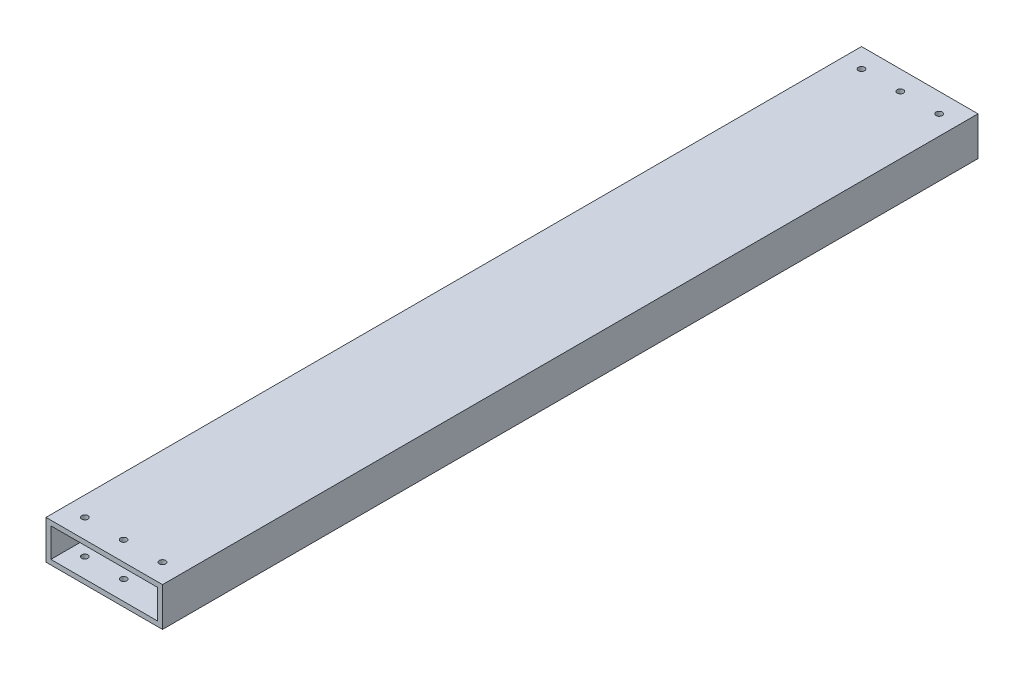
ISO-10303-21;
HEADER;
FILE_DESCRIPTION(('STEP AP214'),'2;1');
FILE_NAME('part.step','',(''),(''),'','','');
FILE_SCHEMA(('AUTOMOTIVE_DESIGN { 1 0 10303 214 1 1 1 1 }'));
ENDSEC;
DATA;
#1=APPLICATION_CONTEXT('core data for automotive mechanical design processes');
#2=APPLICATION_PROTOCOL_DEFINITION('international standard','automotive_design',2000,#1);
#3=PRODUCT_CONTEXT('',#1,'mechanical');
#4=PRODUCT('Part','Part','',(#3));
#5=PRODUCT_RELATED_PRODUCT_CATEGORY('part','',(#4));
#6=PRODUCT_DEFINITION_FORMATION('','',#4);
#7=PRODUCT_DEFINITION_CONTEXT('part definition',#1,'design');
#8=PRODUCT_DEFINITION('design','',#6,#7);
#9=PRODUCT_DEFINITION_SHAPE('','',#8);
#10=(LENGTH_UNIT() NAMED_UNIT(*) SI_UNIT(.MILLI.,.METRE.));
#11=(NAMED_UNIT(*) PLANE_ANGLE_UNIT() SI_UNIT($,.RADIAN.));
#12=(NAMED_UNIT(*) SI_UNIT($,.STERADIAN.) SOLID_ANGLE_UNIT());
#13=UNCERTAINTY_MEASURE_WITH_UNIT(LENGTH_MEASURE(1.E-05),#10,'distance_accuracy_value','');
#14=(GEOMETRIC_REPRESENTATION_CONTEXT(3) GLOBAL_UNCERTAINTY_ASSIGNED_CONTEXT((#13)) GLOBAL_UNIT_ASSIGNED_CONTEXT((#10,
#11,#12)) REPRESENTATION_CONTEXT('',''));
#15=CARTESIAN_POINT('',(0.,0.,0.));
#16=DIRECTION('',(0.,0.,1.));
#17=DIRECTION('',(1.,0.,0.));
#18=AXIS2_PLACEMENT_3D('',#15,#16,#17);
#19=CARTESIAN_POINT('',(0.,0.,266.7));
#20=DIRECTION('',(0.,0.,1.));
#21=DIRECTION('',(1.,0.,0.));
#22=AXIS2_PLACEMENT_3D('',#19,#20,#21);
#23=PLANE('',#22);
#24=DIRECTION('',(0.,1.,0.));
#25=VECTOR('',#24,1.);
#26=CARTESIAN_POINT('',(38.1,-12.7,266.7));
#27=LINE('',#26,#25);
#28=CARTESIAN_POINT('',(38.1,-12.7,266.7));
#29=VERTEX_POINT('',#28);
#30=CARTESIAN_POINT('',(38.1,12.7,266.7));
#31=VERTEX_POINT('',#30);
#32=EDGE_CURVE('E179',#29,#31,#27,.T.);
#33=ORIENTED_EDGE('',*,*,#32,.T.);
#34=DIRECTION('',(-1.,0.,0.));
#35=VECTOR('',#34,1.);
#36=CARTESIAN_POINT('',(-38.1,12.7,266.7));
#37=LINE('',#36,#35);
#38=CARTESIAN_POINT('',(-38.1,12.7,266.7));
#39=VERTEX_POINT('',#38);
#40=EDGE_CURVE('E183',#31,#39,#37,.T.);
#41=ORIENTED_EDGE('',*,*,#40,.T.);
#42=DIRECTION('',(0.,-1.,0.));
#43=VECTOR('',#42,1.);
#44=CARTESIAN_POINT('',(-38.1,-12.7,266.7));
#45=LINE('',#44,#43);
#46=CARTESIAN_POINT('',(-38.1,-12.7,266.7));
#47=VERTEX_POINT('',#46);
#48=EDGE_CURVE('E187',#39,#47,#45,.T.);
#49=ORIENTED_EDGE('',*,*,#48,.T.);
#50=DIRECTION('',(1.,0.,0.));
#51=VECTOR('',#50,1.);
#52=CARTESIAN_POINT('',(-38.1,-12.7,266.7));
#53=LINE('',#52,#51);
#54=EDGE_CURVE('E190',#47,#29,#53,.T.);
#55=ORIENTED_EDGE('',*,*,#54,.T.);
#56=EDGE_LOOP('',(#33,#41,#49,#55));
#57=FACE_BOUND('',#56,.T.);
#58=DIRECTION('',(-1.,0.,0.));
#59=VECTOR('',#58,1.);
#60=CARTESIAN_POINT('',(0.,9.525,266.7));
#61=LINE('',#60,#59);
#62=CARTESIAN_POINT('',(34.925,9.525,266.7));
#63=VERTEX_POINT('',#62);
#64=CARTESIAN_POINT('',(-34.925,9.525,266.7));
#65=VERTEX_POINT('',#64);
#66=EDGE_CURVE('E138',#63,#65,#61,.T.);
#67=ORIENTED_EDGE('',*,*,#66,.F.);
#68=DIRECTION('',(0.,1.,0.));
#69=VECTOR('',#68,1.);
#70=CARTESIAN_POINT('',(34.925,0.,266.7));
#71=LINE('',#70,#69);
#72=CARTESIAN_POINT('',(34.925,-9.525,266.7));
#73=VERTEX_POINT('',#72);
#74=EDGE_CURVE('E129',#73,#63,#71,.T.);
#75=ORIENTED_EDGE('',*,*,#74,.F.);
#76=DIRECTION('',(1.,0.,0.));
#77=VECTOR('',#76,1.);
#78=CARTESIAN_POINT('',(0.,-9.525,266.7));
#79=LINE('',#78,#77);
#80=CARTESIAN_POINT('',(-34.925,-9.525,266.7));
#81=VERTEX_POINT('',#80);
#82=EDGE_CURVE('E155',#81,#73,#79,.T.);
#83=ORIENTED_EDGE('',*,*,#82,.F.);
#84=DIRECTION('',(0.,-1.,0.));
#85=VECTOR('',#84,1.);
#86=CARTESIAN_POINT('',(-34.925,0.,266.7));
#87=LINE('',#86,#85);
#88=EDGE_CURVE('E151',#65,#81,#87,.T.);
#89=ORIENTED_EDGE('',*,*,#88,.F.);
#90=EDGE_LOOP('',(#67,#75,#83,#89));
#91=FACE_BOUND('',#90,.T.);
#92=ADVANCED_FACE('F61',(#57,#91),#23,.T.);
#93=CARTESIAN_POINT('',(0.,0.,-266.7));
#94=DIRECTION('',(0.,0.,1.));
#95=DIRECTION('',(1.,0.,0.));
#96=AXIS2_PLACEMENT_3D('',#93,#94,#95);
#97=PLANE('',#96);
#98=DIRECTION('',(0.,1.,0.));
#99=VECTOR('',#98,1.);
#100=CARTESIAN_POINT('',(38.1,-12.7,-266.7));
#101=LINE('',#100,#99);
#102=CARTESIAN_POINT('',(38.1,-12.7,-266.7));
#103=VERTEX_POINT('',#102);
#104=CARTESIAN_POINT('',(38.1,12.7,-266.7));
#105=VERTEX_POINT('',#104);
#106=EDGE_CURVE('E147',#103,#105,#101,.T.);
#107=ORIENTED_EDGE('',*,*,#106,.F.);
#108=DIRECTION('',(1.,0.,0.));
#109=VECTOR('',#108,1.);
#110=CARTESIAN_POINT('',(-38.1,-12.7,-266.7));
#111=LINE('',#110,#109);
#112=CARTESIAN_POINT('',(-38.1,-12.7,-266.7));
#113=VERTEX_POINT('',#112);
#114=EDGE_CURVE('E184',#113,#103,#111,.T.);
#115=ORIENTED_EDGE('',*,*,#114,.F.);
#116=DIRECTION('',(0.,-1.,0.));
#117=VECTOR('',#116,1.);
#118=CARTESIAN_POINT('',(-38.1,-12.7,-266.7));
#119=LINE('',#118,#117);
#120=CARTESIAN_POINT('',(-38.1,12.7,-266.7));
#121=VERTEX_POINT('',#120);
#122=EDGE_CURVE('E200',#121,#113,#119,.T.);
#123=ORIENTED_EDGE('',*,*,#122,.F.);
#124=DIRECTION('',(-1.,0.,0.));
#125=VECTOR('',#124,1.);
#126=CARTESIAN_POINT('',(-38.1,12.7,-266.7));
#127=LINE('',#126,#125);
#128=EDGE_CURVE('E197',#105,#121,#127,.T.);
#129=ORIENTED_EDGE('',*,*,#128,.F.);
#130=EDGE_LOOP('',(#107,#115,#123,#129));
#131=FACE_BOUND('',#130,.T.);
#132=DIRECTION('',(0.,1.,0.));
#133=VECTOR('',#132,1.);
#134=CARTESIAN_POINT('',(34.925,0.,-266.7));
#135=LINE('',#134,#133);
#136=CARTESIAN_POINT('',(34.925,-9.525,-266.7));
#137=VERTEX_POINT('',#136);
#138=CARTESIAN_POINT('',(34.925,9.525,-266.7));
#139=VERTEX_POINT('',#138);
#140=EDGE_CURVE('E87',#137,#139,#135,.T.);
#141=ORIENTED_EDGE('',*,*,#140,.T.);
#142=DIRECTION('',(-1.,0.,0.));
#143=VECTOR('',#142,1.);
#144=CARTESIAN_POINT('',(0.,9.525,-266.7));
#145=LINE('',#144,#143);
#146=CARTESIAN_POINT('',(-34.925,9.525,-266.7));
#147=VERTEX_POINT('',#146);
#148=EDGE_CURVE('E145',#139,#147,#145,.T.);
#149=ORIENTED_EDGE('',*,*,#148,.T.);
#150=DIRECTION('',(0.,-1.,0.));
#151=VECTOR('',#150,1.);
#152=CARTESIAN_POINT('',(-34.925,0.,-266.7));
#153=LINE('',#152,#151);
#154=CARTESIAN_POINT('',(-34.925,-9.525,-266.7));
#155=VERTEX_POINT('',#154);
#156=EDGE_CURVE('E166',#147,#155,#153,.T.);
#157=ORIENTED_EDGE('',*,*,#156,.T.);
#158=DIRECTION('',(1.,0.,0.));
#159=VECTOR('',#158,1.);
#160=CARTESIAN_POINT('',(0.,-9.525,-266.7));
#161=LINE('',#160,#159);
#162=EDGE_CURVE('E139',#155,#137,#161,.T.);
#163=ORIENTED_EDGE('',*,*,#162,.T.);
#164=EDGE_LOOP('',(#141,#149,#157,#163));
#165=FACE_BOUND('',#164,.T.);
#166=ADVANCED_FACE('F278',(#131,#165),#97,.F.);
#167=CARTESIAN_POINT('',(38.1,-12.7,266.7));
#168=DIRECTION('',(-1.,0.,0.));
#169=DIRECTION('',(0.,0.,1.));
#170=AXIS2_PLACEMENT_3D('',#167,#168,#169);
#171=PLANE('',#170);
#172=ORIENTED_EDGE('',*,*,#106,.T.);
#173=DIRECTION('',(0.,0.,-1.));
#174=VECTOR('',#173,1.);
#175=CARTESIAN_POINT('',(38.1,12.7,266.7));
#176=LINE('',#175,#174);
#177=EDGE_CURVE('E12',#31,#105,#176,.T.);
#178=ORIENTED_EDGE('',*,*,#177,.F.);
#179=ORIENTED_EDGE('',*,*,#32,.F.);
#180=DIRECTION('',(0.,0.,-1.));
#181=VECTOR('',#180,1.);
#182=CARTESIAN_POINT('',(38.1,-12.7,266.7));
#183=LINE('',#182,#181);
#184=EDGE_CURVE('E193',#29,#103,#183,.T.);
#185=ORIENTED_EDGE('',*,*,#184,.T.);
#186=EDGE_LOOP('',(#172,#178,#179,#185));
#187=FACE_BOUND('',#186,.T.);
#188=ADVANCED_FACE('F63',(#187),#171,.F.);
#189=CARTESIAN_POINT('',(-38.1,12.7,266.7));
#190=DIRECTION('',(0.,-1.,0.));
#191=DIRECTION('',(0.,0.,-1.));
#192=AXIS2_PLACEMENT_3D('',#189,#190,#191);
#193=PLANE('',#192);
#194=CARTESIAN_POINT('',(-25.4,12.7,-254.));
#195=DIRECTION('',(0.,1.,0.));
#196=DIRECTION('',(0.,0.,1.));
#197=AXIS2_PLACEMENT_3D('',#194,#195,#196);
#198=CIRCLE('',#197,2.03200000000001);
#199=CARTESIAN_POINT('',(-25.4,12.7,-251.968));
#200=VERTEX_POINT('',#199);
#201=EDGE_CURVE('E314',#200,#200,#198,.T.);
#202=ORIENTED_EDGE('',*,*,#201,.F.);
#203=EDGE_LOOP('',(#202));
#204=FACE_BOUND('',#203,.T.);
#205=CARTESIAN_POINT('',(0.,12.7,254.));
#206=DIRECTION('',(0.,1.,0.));
#207=DIRECTION('',(0.,0.,1.));
#208=AXIS2_PLACEMENT_3D('',#205,#206,#207);
#209=CIRCLE('',#208,2.03200000000002);
#210=CARTESIAN_POINT('',(0.,12.7,256.032));
#211=VERTEX_POINT('',#210);
#212=EDGE_CURVE('E318',#211,#211,#209,.T.);
#213=ORIENTED_EDGE('',*,*,#212,.F.);
#214=EDGE_LOOP('',(#213));
#215=FACE_BOUND('',#214,.T.);
#216=CARTESIAN_POINT('',(25.4,12.7,254.));
#217=DIRECTION('',(0.,1.,0.));
#218=DIRECTION('',(0.,0.,1.));
#219=AXIS2_PLACEMENT_3D('',#216,#217,#218);
#220=CIRCLE('',#219,2.03200000000001);
#221=CARTESIAN_POINT('',(25.4,12.7,256.032));
#222=VERTEX_POINT('',#221);
#223=EDGE_CURVE('E322',#222,#222,#220,.T.);
#224=ORIENTED_EDGE('',*,*,#223,.F.);
#225=EDGE_LOOP('',(#224));
#226=FACE_BOUND('',#225,.T.);
#227=CARTESIAN_POINT('',(0.,12.7,-254.));
#228=DIRECTION('',(0.,1.,0.));
#229=DIRECTION('',(0.,0.,1.));
#230=AXIS2_PLACEMENT_3D('',#227,#228,#229);
#231=CIRCLE('',#230,2.03200000000002);
#232=CARTESIAN_POINT('',(0.,12.7,-251.968));
#233=VERTEX_POINT('',#232);
#234=EDGE_CURVE('E326',#233,#233,#231,.T.);
#235=ORIENTED_EDGE('',*,*,#234,.F.);
#236=EDGE_LOOP('',(#235));
#237=FACE_BOUND('',#236,.T.);
#238=CARTESIAN_POINT('',(-25.4,12.7,254.));
#239=DIRECTION('',(0.,1.,0.));
#240=DIRECTION('',(0.,0.,1.));
#241=AXIS2_PLACEMENT_3D('',#238,#239,#240);
#242=CIRCLE('',#241,2.03200000000001);
#243=CARTESIAN_POINT('',(-25.4,12.7,256.032));
#244=VERTEX_POINT('',#243);
#245=EDGE_CURVE('E330',#244,#244,#242,.T.);
#246=ORIENTED_EDGE('',*,*,#245,.F.);
#247=EDGE_LOOP('',(#246));
#248=FACE_BOUND('',#247,.T.);
#249=CARTESIAN_POINT('',(25.4,12.7,-254.));
#250=DIRECTION('',(0.,1.,0.));
#251=DIRECTION('',(0.,0.,1.));
#252=AXIS2_PLACEMENT_3D('',#249,#250,#251);
#253=CIRCLE('',#252,2.03200000000001);
#254=CARTESIAN_POINT('',(25.4,12.7,-251.968));
#255=VERTEX_POINT('',#254);
#256=EDGE_CURVE('E334',#255,#255,#253,.T.);
#257=ORIENTED_EDGE('',*,*,#256,.F.);
#258=EDGE_LOOP('',(#257));
#259=FACE_BOUND('',#258,.T.);
#260=ORIENTED_EDGE('',*,*,#128,.T.);
#261=DIRECTION('',(0.,0.,-1.));
#262=VECTOR('',#261,1.);
#263=CARTESIAN_POINT('',(-38.1,12.7,266.7));
#264=LINE('',#263,#262);
#265=EDGE_CURVE('E71',#39,#121,#264,.T.);
#266=ORIENTED_EDGE('',*,*,#265,.F.);
#267=ORIENTED_EDGE('',*,*,#40,.F.);
#268=ORIENTED_EDGE('',*,*,#177,.T.);
#269=EDGE_LOOP('',(#260,#266,#267,#268));
#270=FACE_BOUND('',#269,.T.);
#271=ADVANCED_FACE('F303',(#204,#215,#226,#237,#248,#259,#270),#193,.F.);
#272=CARTESIAN_POINT('',(-38.1,-12.7,266.7));
#273=DIRECTION('',(1.,0.,0.));
#274=DIRECTION('',(0.,0.,-1.));
#275=AXIS2_PLACEMENT_3D('',#272,#273,#274);
#276=PLANE('',#275);
#277=ORIENTED_EDGE('',*,*,#122,.T.);
#278=DIRECTION('',(0.,0.,-1.));
#279=VECTOR('',#278,1.);
#280=CARTESIAN_POINT('',(-38.1,-12.7,266.7));
#281=LINE('',#280,#279);
#282=EDGE_CURVE('E208',#47,#113,#281,.T.);
#283=ORIENTED_EDGE('',*,*,#282,.F.);
#284=ORIENTED_EDGE('',*,*,#48,.F.);
#285=ORIENTED_EDGE('',*,*,#265,.T.);
#286=EDGE_LOOP('',(#277,#283,#284,#285));
#287=FACE_BOUND('',#286,.T.);
#288=ADVANCED_FACE('F300',(#287),#276,.F.);
#289=CARTESIAN_POINT('',(-38.1,-12.7,266.7));
#290=DIRECTION('',(0.,1.,0.));
#291=DIRECTION('',(0.,0.,1.));
#292=AXIS2_PLACEMENT_3D('',#289,#290,#291);
#293=PLANE('',#292);
#294=CARTESIAN_POINT('',(-25.4,-12.7,-254.));
#295=DIRECTION('',(0.,1.,0.));
#296=DIRECTION('',(0.,0.,1.));
#297=AXIS2_PLACEMENT_3D('',#294,#295,#296);
#298=CIRCLE('',#297,2.03200000000001);
#299=CARTESIAN_POINT('',(-25.4,-12.7,-251.968));
#300=VERTEX_POINT('',#299);
#301=EDGE_CURVE('E432',#300,#300,#298,.T.);
#302=ORIENTED_EDGE('',*,*,#301,.T.);
#303=EDGE_LOOP('',(#302));
#304=FACE_BOUND('',#303,.T.);
#305=CARTESIAN_POINT('',(0.,-12.7,254.));
#306=DIRECTION('',(0.,1.,0.));
#307=DIRECTION('',(0.,0.,1.));
#308=AXIS2_PLACEMENT_3D('',#305,#306,#307);
#309=CIRCLE('',#308,2.03200000000002);
#310=CARTESIAN_POINT('',(0.,-12.7,256.032));
#311=VERTEX_POINT('',#310);
#312=EDGE_CURVE('E420',#311,#311,#309,.T.);
#313=ORIENTED_EDGE('',*,*,#312,.T.);
#314=EDGE_LOOP('',(#313));
#315=FACE_BOUND('',#314,.T.);
#316=CARTESIAN_POINT('',(25.4,-12.7,254.));
#317=DIRECTION('',(0.,1.,0.));
#318=DIRECTION('',(0.,0.,1.));
#319=AXIS2_PLACEMENT_3D('',#316,#317,#318);
#320=CIRCLE('',#319,2.03200000000001);
#321=CARTESIAN_POINT('',(25.4,-12.7,256.032));
#322=VERTEX_POINT('',#321);
#323=EDGE_CURVE('E419',#322,#322,#320,.T.);
#324=ORIENTED_EDGE('',*,*,#323,.T.);
#325=EDGE_LOOP('',(#324));
#326=FACE_BOUND('',#325,.T.);
#327=CARTESIAN_POINT('',(0.,-12.7,-254.));
#328=DIRECTION('',(0.,1.,0.));
#329=DIRECTION('',(0.,0.,1.));
#330=AXIS2_PLACEMENT_3D('',#327,#328,#329);
#331=CIRCLE('',#330,2.03200000000002);
#332=CARTESIAN_POINT('',(0.,-12.7,-251.968));
#333=VERTEX_POINT('',#332);
#334=EDGE_CURVE('E348',#333,#333,#331,.T.);
#335=ORIENTED_EDGE('',*,*,#334,.T.);
#336=EDGE_LOOP('',(#335));
#337=FACE_BOUND('',#336,.T.);
#338=CARTESIAN_POINT('',(-25.4,-12.7,254.));
#339=DIRECTION('',(0.,1.,0.));
#340=DIRECTION('',(0.,0.,1.));
#341=AXIS2_PLACEMENT_3D('',#338,#339,#340);
#342=CIRCLE('',#341,2.03200000000001);
#343=CARTESIAN_POINT('',(-25.4,-12.7,256.032));
#344=VERTEX_POINT('',#343);
#345=EDGE_CURVE('E433',#344,#344,#342,.T.);
#346=ORIENTED_EDGE('',*,*,#345,.T.);
#347=EDGE_LOOP('',(#346));
#348=FACE_BOUND('',#347,.T.);
#349=CARTESIAN_POINT('',(25.4,-12.7,-254.));
#350=DIRECTION('',(0.,1.,0.));
#351=DIRECTION('',(0.,0.,1.));
#352=AXIS2_PLACEMENT_3D('',#349,#350,#351);
#353=CIRCLE('',#352,2.03200000000001);
#354=CARTESIAN_POINT('',(25.4,-12.7,-251.968));
#355=VERTEX_POINT('',#354);
#356=EDGE_CURVE('E220',#355,#355,#353,.T.);
#357=ORIENTED_EDGE('',*,*,#356,.T.);
#358=EDGE_LOOP('',(#357));
#359=FACE_BOUND('',#358,.T.);
#360=ORIENTED_EDGE('',*,*,#114,.T.);
#361=ORIENTED_EDGE('',*,*,#184,.F.);
#362=ORIENTED_EDGE('',*,*,#54,.F.);
#363=ORIENTED_EDGE('',*,*,#282,.T.);
#364=EDGE_LOOP('',(#360,#361,#362,#363));
#365=FACE_BOUND('',#364,.T.);
#366=ADVANCED_FACE('F297',(#304,#315,#326,#337,#348,#359,#365),#293,.F.);
#367=CARTESIAN_POINT('',(34.925,0.,266.7));
#368=DIRECTION('',(-1.,0.,0.));
#369=DIRECTION('',(0.,0.,1.));
#370=AXIS2_PLACEMENT_3D('',#367,#368,#369);
#371=PLANE('',#370);
#372=ORIENTED_EDGE('',*,*,#140,.F.);
#373=DIRECTION('',(0.,0.,-1.));
#374=VECTOR('',#373,1.);
#375=CARTESIAN_POINT('',(34.925,-9.525,266.7));
#376=LINE('',#375,#374);
#377=EDGE_CURVE('E133',#73,#137,#376,.T.);
#378=ORIENTED_EDGE('',*,*,#377,.F.);
#379=ORIENTED_EDGE('',*,*,#74,.T.);
#380=DIRECTION('',(0.,0.,-1.));
#381=VECTOR('',#380,1.);
#382=CARTESIAN_POINT('',(34.925,9.525,266.7));
#383=LINE('',#382,#381);
#384=EDGE_CURVE('E132',#63,#139,#383,.T.);
#385=ORIENTED_EDGE('',*,*,#384,.T.);
#386=EDGE_LOOP('',(#372,#378,#379,#385));
#387=FACE_BOUND('',#386,.T.);
#388=ADVANCED_FACE('F131',(#387),#371,.T.);
#389=CARTESIAN_POINT('',(0.,9.525,266.7));
#390=DIRECTION('',(0.,-1.,0.));
#391=DIRECTION('',(0.,0.,-1.));
#392=AXIS2_PLACEMENT_3D('',#389,#390,#391);
#393=PLANE('',#392);
#394=CARTESIAN_POINT('',(-25.4,9.525,-254.));
#395=DIRECTION('',(0.,-1.,0.));
#396=DIRECTION('',(0.,0.,-1.));
#397=AXIS2_PLACEMENT_3D('',#394,#395,#396);
#398=CIRCLE('',#397,2.03200000000001);
#399=CARTESIAN_POINT('',(-25.4,9.525,-256.032));
#400=VERTEX_POINT('',#399);
#401=EDGE_CURVE('E163',#400,#400,#398,.T.);
#402=ORIENTED_EDGE('',*,*,#401,.F.);
#403=EDGE_LOOP('',(#402));
#404=FACE_BOUND('',#403,.T.);
#405=CARTESIAN_POINT('',(0.,9.525,254.));
#406=DIRECTION('',(0.,-1.,0.));
#407=DIRECTION('',(0.,0.,-1.));
#408=AXIS2_PLACEMENT_3D('',#405,#406,#407);
#409=CIRCLE('',#408,2.03200000000002);
#410=CARTESIAN_POINT('',(0.,9.525,251.968));
#411=VERTEX_POINT('',#410);
#412=EDGE_CURVE('E238',#411,#411,#409,.T.);
#413=ORIENTED_EDGE('',*,*,#412,.F.);
#414=EDGE_LOOP('',(#413));
#415=FACE_BOUND('',#414,.T.);
#416=CARTESIAN_POINT('',(25.4,9.525,254.));
#417=DIRECTION('',(0.,-1.,0.));
#418=DIRECTION('',(0.,0.,-1.));
#419=AXIS2_PLACEMENT_3D('',#416,#417,#418);
#420=CIRCLE('',#419,2.03200000000001);
#421=CARTESIAN_POINT('',(25.4,9.525,251.968));
#422=VERTEX_POINT('',#421);
#423=EDGE_CURVE('E234',#422,#422,#420,.T.);
#424=ORIENTED_EDGE('',*,*,#423,.F.);
#425=EDGE_LOOP('',(#424));
#426=FACE_BOUND('',#425,.T.);
#427=CARTESIAN_POINT('',(0.,9.525,-254.));
#428=DIRECTION('',(0.,-1.,0.));
#429=DIRECTION('',(0.,0.,-1.));
#430=AXIS2_PLACEMENT_3D('',#427,#428,#429);
#431=CIRCLE('',#430,2.03200000000002);
#432=CARTESIAN_POINT('',(0.,9.525,-256.032));
#433=VERTEX_POINT('',#432);
#434=EDGE_CURVE('E230',#433,#433,#431,.T.);
#435=ORIENTED_EDGE('',*,*,#434,.F.);
#436=EDGE_LOOP('',(#435));
#437=FACE_BOUND('',#436,.T.);
#438=CARTESIAN_POINT('',(-25.4,9.525,254.));
#439=DIRECTION('',(0.,-1.,0.));
#440=DIRECTION('',(0.,0.,-1.));
#441=AXIS2_PLACEMENT_3D('',#438,#439,#440);
#442=CIRCLE('',#441,2.03200000000001);
#443=CARTESIAN_POINT('',(-25.4,9.525,251.968));
#444=VERTEX_POINT('',#443);
#445=EDGE_CURVE('E225',#444,#444,#442,.T.);
#446=ORIENTED_EDGE('',*,*,#445,.F.);
#447=EDGE_LOOP('',(#446));
#448=FACE_BOUND('',#447,.T.);
#449=CARTESIAN_POINT('',(25.4,9.525,-254.));
#450=DIRECTION('',(0.,-1.,0.));
#451=DIRECTION('',(0.,0.,-1.));
#452=AXIS2_PLACEMENT_3D('',#449,#450,#451);
#453=CIRCLE('',#452,2.03200000000001);
#454=CARTESIAN_POINT('',(25.4,9.525,-256.032));
#455=VERTEX_POINT('',#454);
#456=EDGE_CURVE('E219',#455,#455,#453,.T.);
#457=ORIENTED_EDGE('',*,*,#456,.F.);
#458=EDGE_LOOP('',(#457));
#459=FACE_BOUND('',#458,.T.);
#460=ORIENTED_EDGE('',*,*,#148,.F.);
#461=ORIENTED_EDGE('',*,*,#384,.F.);
#462=ORIENTED_EDGE('',*,*,#66,.T.);
#463=DIRECTION('',(0.,0.,-1.));
#464=VECTOR('',#463,1.);
#465=CARTESIAN_POINT('',(-34.925,9.525,266.7));
#466=LINE('',#465,#464);
#467=EDGE_CURVE('E148',#65,#147,#466,.T.);
#468=ORIENTED_EDGE('',*,*,#467,.T.);
#469=EDGE_LOOP('',(#460,#461,#462,#468));
#470=FACE_BOUND('',#469,.T.);
#471=ADVANCED_FACE('F142',(#404,#415,#426,#437,#448,#459,#470),#393,.T.);
#472=CARTESIAN_POINT('',(-34.925,0.,266.7));
#473=DIRECTION('',(1.,0.,0.));
#474=DIRECTION('',(0.,0.,-1.));
#475=AXIS2_PLACEMENT_3D('',#472,#473,#474);
#476=PLANE('',#475);
#477=ORIENTED_EDGE('',*,*,#156,.F.);
#478=ORIENTED_EDGE('',*,*,#467,.F.);
#479=ORIENTED_EDGE('',*,*,#88,.T.);
#480=DIRECTION('',(0.,0.,-1.));
#481=VECTOR('',#480,1.);
#482=CARTESIAN_POINT('',(-34.925,-9.525,266.7));
#483=LINE('',#482,#481);
#484=EDGE_CURVE('E79',#81,#155,#483,.T.);
#485=ORIENTED_EDGE('',*,*,#484,.T.);
#486=EDGE_LOOP('',(#477,#478,#479,#485));
#487=FACE_BOUND('',#486,.T.);
#488=ADVANCED_FACE('F266',(#487),#476,.T.);
#489=CARTESIAN_POINT('',(0.,-9.525,266.7));
#490=DIRECTION('',(0.,1.,0.));
#491=DIRECTION('',(0.,0.,1.));
#492=AXIS2_PLACEMENT_3D('',#489,#490,#491);
#493=PLANE('',#492);
#494=CARTESIAN_POINT('',(-25.4,-9.525,-254.));
#495=DIRECTION('',(0.,1.,0.));
#496=DIRECTION('',(0.,0.,1.));
#497=AXIS2_PLACEMENT_3D('',#494,#495,#496);
#498=CIRCLE('',#497,2.03200000000001);
#499=CARTESIAN_POINT('',(-25.4,-9.525,-251.968));
#500=VERTEX_POINT('',#499);
#501=EDGE_CURVE('E65',#500,#500,#498,.T.);
#502=ORIENTED_EDGE('',*,*,#501,.F.);
#503=EDGE_LOOP('',(#502));
#504=FACE_BOUND('',#503,.T.);
#505=CARTESIAN_POINT('',(0.,-9.525,254.));
#506=DIRECTION('',(0.,1.,0.));
#507=DIRECTION('',(0.,0.,1.));
#508=AXIS2_PLACEMENT_3D('',#505,#506,#507);
#509=CIRCLE('',#508,2.03200000000002);
#510=CARTESIAN_POINT('',(0.,-9.525,256.032));
#511=VERTEX_POINT('',#510);
#512=EDGE_CURVE('E235',#511,#511,#509,.T.);
#513=ORIENTED_EDGE('',*,*,#512,.F.);
#514=EDGE_LOOP('',(#513));
#515=FACE_BOUND('',#514,.T.);
#516=CARTESIAN_POINT('',(25.4,-9.525,254.));
#517=DIRECTION('',(0.,1.,0.));
#518=DIRECTION('',(0.,0.,1.));
#519=AXIS2_PLACEMENT_3D('',#516,#517,#518);
#520=CIRCLE('',#519,2.03200000000001);
#521=CARTESIAN_POINT('',(25.4,-9.525,256.032));
#522=VERTEX_POINT('',#521);
#523=EDGE_CURVE('E231',#522,#522,#520,.T.);
#524=ORIENTED_EDGE('',*,*,#523,.F.);
#525=EDGE_LOOP('',(#524));
#526=FACE_BOUND('',#525,.T.);
#527=CARTESIAN_POINT('',(0.,-9.525,-254.));
#528=DIRECTION('',(0.,1.,0.));
#529=DIRECTION('',(0.,0.,1.));
#530=AXIS2_PLACEMENT_3D('',#527,#528,#529);
#531=CIRCLE('',#530,2.03200000000002);
#532=CARTESIAN_POINT('',(0.,-9.525,-251.968));
#533=VERTEX_POINT('',#532);
#534=EDGE_CURVE('E226',#533,#533,#531,.T.);
#535=ORIENTED_EDGE('',*,*,#534,.F.);
#536=EDGE_LOOP('',(#535));
#537=FACE_BOUND('',#536,.T.);
#538=CARTESIAN_POINT('',(-25.4,-9.525,254.));
#539=DIRECTION('',(0.,1.,0.));
#540=DIRECTION('',(0.,0.,1.));
#541=AXIS2_PLACEMENT_3D('',#538,#539,#540);
#542=CIRCLE('',#541,2.03200000000001);
#543=CARTESIAN_POINT('',(-25.4,-9.525,256.032));
#544=VERTEX_POINT('',#543);
#545=EDGE_CURVE('E221',#544,#544,#542,.T.);
#546=ORIENTED_EDGE('',*,*,#545,.F.);
#547=EDGE_LOOP('',(#546));
#548=FACE_BOUND('',#547,.T.);
#549=CARTESIAN_POINT('',(25.4,-9.525,-254.));
#550=DIRECTION('',(0.,1.,0.));
#551=DIRECTION('',(0.,0.,1.));
#552=AXIS2_PLACEMENT_3D('',#549,#550,#551);
#553=CIRCLE('',#552,2.03200000000001);
#554=CARTESIAN_POINT('',(25.4,-9.525,-251.968));
#555=VERTEX_POINT('',#554);
#556=EDGE_CURVE('E215',#555,#555,#553,.T.);
#557=ORIENTED_EDGE('',*,*,#556,.F.);
#558=EDGE_LOOP('',(#557));
#559=FACE_BOUND('',#558,.T.);
#560=ORIENTED_EDGE('',*,*,#162,.F.);
#561=ORIENTED_EDGE('',*,*,#484,.F.);
#562=ORIENTED_EDGE('',*,*,#82,.T.);
#563=ORIENTED_EDGE('',*,*,#377,.T.);
#564=EDGE_LOOP('',(#560,#561,#562,#563));
#565=FACE_BOUND('',#564,.T.);
#566=ADVANCED_FACE('F262',(#504,#515,#526,#537,#548,#559,#565),#493,.T.);
#567=CARTESIAN_POINT('',(25.4,-12.7,-254.));
#568=DIRECTION('',(0.,1.,0.));
#569=DIRECTION('',(0.,0.,1.));
#570=AXIS2_PLACEMENT_3D('',#567,#568,#569);
#571=CYLINDRICAL_SURFACE('',#570,2.03200000000001);
#572=ORIENTED_EDGE('',*,*,#556,.T.);
#573=EDGE_LOOP('',(#572));
#574=FACE_BOUND('',#573,.T.);
#575=ORIENTED_EDGE('',*,*,#356,.F.);
#576=EDGE_LOOP('',(#575));
#577=FACE_BOUND('',#576,.T.);
#578=ADVANCED_FACE('F265',(#574,#577),#571,.F.);
#579=CARTESIAN_POINT('',(-25.4,-12.7,254.));
#580=DIRECTION('',(0.,1.,0.));
#581=DIRECTION('',(0.,0.,1.));
#582=AXIS2_PLACEMENT_3D('',#579,#580,#581);
#583=CYLINDRICAL_SURFACE('',#582,2.03200000000001);
#584=ORIENTED_EDGE('',*,*,#545,.T.);
#585=EDGE_LOOP('',(#584));
#586=FACE_BOUND('',#585,.T.);
#587=ORIENTED_EDGE('',*,*,#345,.F.);
#588=EDGE_LOOP('',(#587));
#589=FACE_BOUND('',#588,.T.);
#590=ADVANCED_FACE('F379',(#586,#589),#583,.F.);
#591=CARTESIAN_POINT('',(0.,-12.7,-254.));
#592=DIRECTION('',(0.,1.,0.));
#593=DIRECTION('',(0.,0.,1.));
#594=AXIS2_PLACEMENT_3D('',#591,#592,#593);
#595=CYLINDRICAL_SURFACE('',#594,2.03200000000002);
#596=ORIENTED_EDGE('',*,*,#534,.T.);
#597=EDGE_LOOP('',(#596));
#598=FACE_BOUND('',#597,.T.);
#599=ORIENTED_EDGE('',*,*,#334,.F.);
#600=EDGE_LOOP('',(#599));
#601=FACE_BOUND('',#600,.T.);
#602=ADVANCED_FACE('F389',(#598,#601),#595,.F.);
#603=CARTESIAN_POINT('',(25.4,-12.7,254.));
#604=DIRECTION('',(0.,1.,0.));
#605=DIRECTION('',(0.,0.,1.));
#606=AXIS2_PLACEMENT_3D('',#603,#604,#605);
#607=CYLINDRICAL_SURFACE('',#606,2.03200000000001);
#608=ORIENTED_EDGE('',*,*,#523,.T.);
#609=EDGE_LOOP('',(#608));
#610=FACE_BOUND('',#609,.T.);
#611=ORIENTED_EDGE('',*,*,#323,.F.);
#612=EDGE_LOOP('',(#611));
#613=FACE_BOUND('',#612,.T.);
#614=ADVANCED_FACE('F397',(#610,#613),#607,.F.);
#615=CARTESIAN_POINT('',(0.,-12.7,254.));
#616=DIRECTION('',(0.,1.,0.));
#617=DIRECTION('',(0.,0.,1.));
#618=AXIS2_PLACEMENT_3D('',#615,#616,#617);
#619=CYLINDRICAL_SURFACE('',#618,2.03200000000002);
#620=ORIENTED_EDGE('',*,*,#512,.T.);
#621=EDGE_LOOP('',(#620));
#622=FACE_BOUND('',#621,.T.);
#623=ORIENTED_EDGE('',*,*,#312,.F.);
#624=EDGE_LOOP('',(#623));
#625=FACE_BOUND('',#624,.T.);
#626=ADVANCED_FACE('F380',(#622,#625),#619,.F.);
#627=CARTESIAN_POINT('',(-25.4,-12.7,-254.));
#628=DIRECTION('',(0.,1.,0.));
#629=DIRECTION('',(0.,0.,1.));
#630=AXIS2_PLACEMENT_3D('',#627,#628,#629);
#631=CYLINDRICAL_SURFACE('',#630,2.03200000000001);
#632=ORIENTED_EDGE('',*,*,#501,.T.);
#633=EDGE_LOOP('',(#632));
#634=FACE_BOUND('',#633,.T.);
#635=ORIENTED_EDGE('',*,*,#301,.F.);
#636=EDGE_LOOP('',(#635));
#637=FACE_BOUND('',#636,.T.);
#638=ADVANCED_FACE('F259',(#634,#637),#631,.F.);
#639=ORIENTED_EDGE('',*,*,#456,.T.);
#640=EDGE_LOOP('',(#639));
#641=FACE_BOUND('',#640,.T.);
#642=ORIENTED_EDGE('',*,*,#256,.T.);
#643=EDGE_LOOP('',(#642));
#644=FACE_BOUND('',#643,.T.);
#645=ADVANCED_FACE('F370',(#641,#644),#571,.F.);
#646=ORIENTED_EDGE('',*,*,#445,.T.);
#647=EDGE_LOOP('',(#646));
#648=FACE_BOUND('',#647,.T.);
#649=ORIENTED_EDGE('',*,*,#245,.T.);
#650=EDGE_LOOP('',(#649));
#651=FACE_BOUND('',#650,.T.);
#652=ADVANCED_FACE('F364',(#648,#651),#583,.F.);
#653=ORIENTED_EDGE('',*,*,#434,.T.);
#654=EDGE_LOOP('',(#653));
#655=FACE_BOUND('',#654,.T.);
#656=ORIENTED_EDGE('',*,*,#234,.T.);
#657=EDGE_LOOP('',(#656));
#658=FACE_BOUND('',#657,.T.);
#659=ADVANCED_FACE('F377',(#655,#658),#595,.F.);
#660=ORIENTED_EDGE('',*,*,#423,.T.);
#661=EDGE_LOOP('',(#660));
#662=FACE_BOUND('',#661,.T.);
#663=ORIENTED_EDGE('',*,*,#223,.T.);
#664=EDGE_LOOP('',(#663));
#665=FACE_BOUND('',#664,.T.);
#666=ADVANCED_FACE('F406',(#662,#665),#607,.F.);
#667=ORIENTED_EDGE('',*,*,#412,.T.);
#668=EDGE_LOOP('',(#667));
#669=FACE_BOUND('',#668,.T.);
#670=ORIENTED_EDGE('',*,*,#212,.T.);
#671=EDGE_LOOP('',(#670));
#672=FACE_BOUND('',#671,.T.);
#673=ADVANCED_FACE('F403',(#669,#672),#619,.F.);
#674=ORIENTED_EDGE('',*,*,#401,.T.);
#675=EDGE_LOOP('',(#674));
#676=FACE_BOUND('',#675,.T.);
#677=ORIENTED_EDGE('',*,*,#201,.T.);
#678=EDGE_LOOP('',(#677));
#679=FACE_BOUND('',#678,.T.);
#680=ADVANCED_FACE('F382',(#676,#679),#631,.F.);
#681=CLOSED_SHELL('',(#92,#166,#188,#271,#288,#366,#388,#471,#488,#566,#578,#590,#602,#614,#626,
#638,#645,#652,#659,#666,#673,#680));
#682=MANIFOLD_SOLID_BREP('B2',#681);
#683=ADVANCED_BREP_SHAPE_REPRESENTATION('',(#18,#682),#14);
#684=SHAPE_DEFINITION_REPRESENTATION(#9,#683);
ENDSEC;
END-ISO-10303-21;
